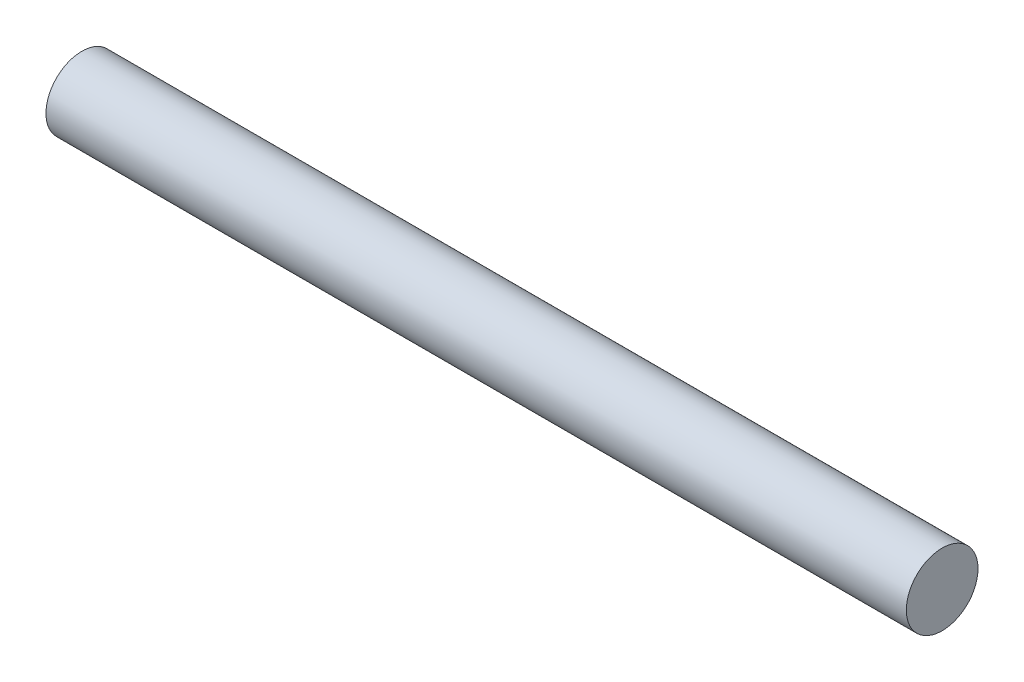
ISO-10303-21;
HEADER;
FILE_DESCRIPTION(('STEP AP214'),'2;1');
FILE_NAME('part.step','',(''),(''),'','','');
FILE_SCHEMA(('AUTOMOTIVE_DESIGN { 1 0 10303 214 1 1 1 1 }'));
ENDSEC;
DATA;
#1=APPLICATION_CONTEXT('core data for automotive mechanical design processes');
#2=APPLICATION_PROTOCOL_DEFINITION('international standard','automotive_design',2000,#1);
#3=PRODUCT_CONTEXT('',#1,'mechanical');
#4=PRODUCT('Part','Part','',(#3));
#5=PRODUCT_RELATED_PRODUCT_CATEGORY('part','',(#4));
#6=PRODUCT_DEFINITION_FORMATION('','',#4);
#7=PRODUCT_DEFINITION_CONTEXT('part definition',#1,'design');
#8=PRODUCT_DEFINITION('design','',#6,#7);
#9=PRODUCT_DEFINITION_SHAPE('','',#8);
#10=(LENGTH_UNIT() NAMED_UNIT(*) SI_UNIT(.MILLI.,.METRE.));
#11=(NAMED_UNIT(*) PLANE_ANGLE_UNIT() SI_UNIT($,.RADIAN.));
#12=(NAMED_UNIT(*) SI_UNIT($,.STERADIAN.) SOLID_ANGLE_UNIT());
#13=UNCERTAINTY_MEASURE_WITH_UNIT(LENGTH_MEASURE(1.E-05),#10,'distance_accuracy_value','');
#14=(GEOMETRIC_REPRESENTATION_CONTEXT(3) GLOBAL_UNCERTAINTY_ASSIGNED_CONTEXT((#13)) GLOBAL_UNIT_ASSIGNED_CONTEXT((#10,
#11,#12)) REPRESENTATION_CONTEXT('',''));
#15=CARTESIAN_POINT('',(0.,0.,0.));
#16=DIRECTION('',(0.,0.,1.));
#17=DIRECTION('',(1.,0.,0.));
#18=AXIS2_PLACEMENT_3D('',#15,#16,#17);
#19=CARTESIAN_POINT('',(96.,0.,0.));
#20=DIRECTION('',(-1.,0.,0.));
#21=DIRECTION('',(0.,0.,1.));
#22=AXIS2_PLACEMENT_3D('',#19,#20,#21);
#23=CYLINDRICAL_SURFACE('',#22,4.);
#24=CARTESIAN_POINT('',(96.,0.,0.));
#25=DIRECTION('',(1.,0.,0.));
#26=DIRECTION('',(0.,0.,-1.));
#27=AXIS2_PLACEMENT_3D('',#24,#25,#26);
#28=CIRCLE('',#27,4.);
#29=CARTESIAN_POINT('',(96.,0.,-4.));
#30=VERTEX_POINT('',#29);
#31=EDGE_CURVE('E10',#30,#30,#28,.T.);
#32=ORIENTED_EDGE('',*,*,#31,.F.);
#33=EDGE_LOOP('',(#32));
#34=FACE_BOUND('',#33,.T.);
#35=CARTESIAN_POINT('',(0.,0.,0.));
#36=DIRECTION('',(1.,0.,0.));
#37=DIRECTION('',(0.,0.,-1.));
#38=AXIS2_PLACEMENT_3D('',#35,#36,#37);
#39=CIRCLE('',#38,4.);
#40=CARTESIAN_POINT('',(0.,0.,-4.));
#41=VERTEX_POINT('',#40);
#42=EDGE_CURVE('E36',#41,#41,#39,.T.);
#43=ORIENTED_EDGE('',*,*,#42,.T.);
#44=EDGE_LOOP('',(#43));
#45=FACE_BOUND('',#44,.T.);
#46=ADVANCED_FACE('F33',(#34,#45),#23,.T.);
#47=CARTESIAN_POINT('',(96.,0.,0.));
#48=DIRECTION('',(1.,0.,0.));
#49=DIRECTION('',(0.,0.,-1.));
#50=AXIS2_PLACEMENT_3D('',#47,#48,#49);
#51=PLANE('',#50);
#52=ORIENTED_EDGE('',*,*,#31,.T.);
#53=EDGE_LOOP('',(#52));
#54=FACE_BOUND('',#53,.T.);
#55=ADVANCED_FACE('F48',(#54),#51,.T.);
#56=CARTESIAN_POINT('',(0.,0.,0.));
#57=DIRECTION('',(1.,0.,0.));
#58=DIRECTION('',(0.,0.,-1.));
#59=AXIS2_PLACEMENT_3D('',#56,#57,#58);
#60=PLANE('',#59);
#61=ORIENTED_EDGE('',*,*,#42,.F.);
#62=EDGE_LOOP('',(#61));
#63=FACE_BOUND('',#62,.T.);
#64=ADVANCED_FACE('F46',(#63),#60,.F.);
#65=CLOSED_SHELL('',(#46,#55,#64));
#66=MANIFOLD_SOLID_BREP('B2',#65);
#67=ADVANCED_BREP_SHAPE_REPRESENTATION('',(#18,#66),#14);
#68=SHAPE_DEFINITION_REPRESENTATION(#9,#67);
ENDSEC;
END-ISO-10303-21;
